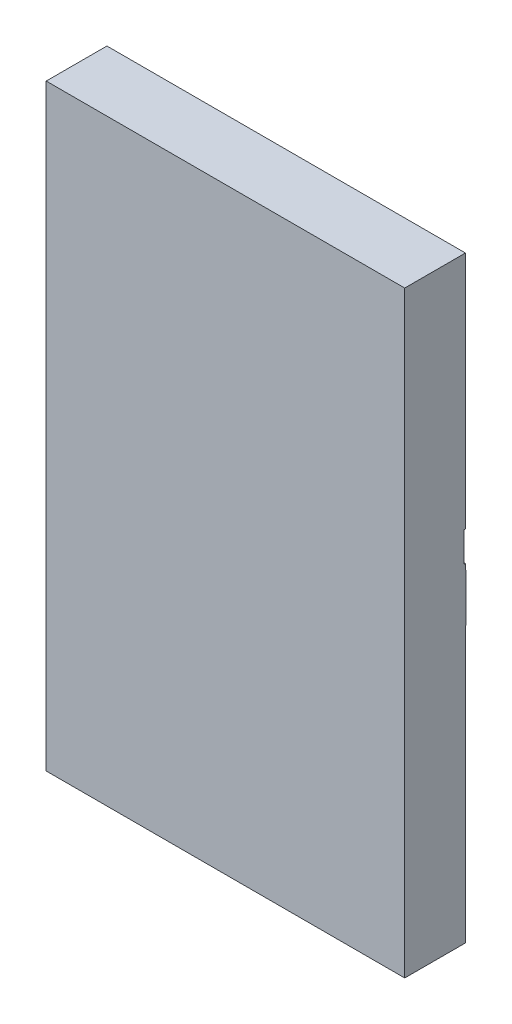
ISO-10303-21;
HEADER;
FILE_DESCRIPTION(('STEP AP214'),'2;1');
FILE_NAME('part.step','',(''),(''),'','','');
FILE_SCHEMA(('AUTOMOTIVE_DESIGN { 1 0 10303 214 1 1 1 1 }'));
ENDSEC;
DATA;
#1=APPLICATION_CONTEXT('core data for automotive mechanical design processes');
#2=APPLICATION_PROTOCOL_DEFINITION('international standard','automotive_design',2000,#1);
#3=PRODUCT_CONTEXT('',#1,'mechanical');
#4=PRODUCT('Part','Part','',(#3));
#5=PRODUCT_RELATED_PRODUCT_CATEGORY('part','',(#4));
#6=PRODUCT_DEFINITION_FORMATION('','',#4);
#7=PRODUCT_DEFINITION_CONTEXT('part definition',#1,'design');
#8=PRODUCT_DEFINITION('design','',#6,#7);
#9=PRODUCT_DEFINITION_SHAPE('','',#8);
#10=(LENGTH_UNIT() NAMED_UNIT(*) SI_UNIT(.MILLI.,.METRE.));
#11=(NAMED_UNIT(*) PLANE_ANGLE_UNIT() SI_UNIT($,.RADIAN.));
#12=(NAMED_UNIT(*) SI_UNIT($,.STERADIAN.) SOLID_ANGLE_UNIT());
#13=UNCERTAINTY_MEASURE_WITH_UNIT(LENGTH_MEASURE(1.E-05),#10,'distance_accuracy_value','');
#14=(GEOMETRIC_REPRESENTATION_CONTEXT(3) GLOBAL_UNCERTAINTY_ASSIGNED_CONTEXT((#13)) GLOBAL_UNIT_ASSIGNED_CONTEXT((#10,
#11,#12)) REPRESENTATION_CONTEXT('',''));
#15=CARTESIAN_POINT('',(0.,0.,0.));
#16=DIRECTION('',(0.,0.,1.));
#17=DIRECTION('',(1.,0.,0.));
#18=AXIS2_PLACEMENT_3D('',#15,#16,#17);
#19=CARTESIAN_POINT('',(0.00100000000000012,2.75,-0.100000000000003));
#20=DIRECTION('',(0.,0.,-1.));
#21=DIRECTION('',(0.,1.,0.));
#22=AXIS2_PLACEMENT_3D('',#19,#20,#21);
#23=PLANE('',#22);
#24=DIRECTION('',(1.,0.,0.));
#25=VECTOR('',#24,1.);
#26=CARTESIAN_POINT('',(0.000999999999999855,2.505,-0.100000000000002));
#27=LINE('',#26,#25);
#28=CARTESIAN_POINT('',(0.00100000000000013,2.505,-0.100000000000002));
#29=VERTEX_POINT('',#28);
#30=CARTESIAN_POINT('',(2.001,2.505,-0.100000000000002));
#31=VERTEX_POINT('',#30);
#32=EDGE_CURVE('E44',#29,#31,#27,.T.);
#33=ORIENTED_EDGE('',*,*,#32,.F.);
#34=DIRECTION('',(0.,1.,0.));
#35=VECTOR('',#34,1.);
#36=CARTESIAN_POINT('',(0.00100000000000012,2.25,-0.100000000000002));
#37=LINE('',#36,#35);
#38=CARTESIAN_POINT('',(0.00100000000000012,2.75,-0.100000000000003));
#39=VERTEX_POINT('',#38);
#40=EDGE_CURVE('E240',#29,#39,#37,.T.);
#41=ORIENTED_EDGE('',*,*,#40,.T.);
#42=DIRECTION('',(1.,0.,0.));
#43=VECTOR('',#42,1.);
#44=CARTESIAN_POINT('',(0.00100000000000012,2.75,-0.100000000000003));
#45=LINE('',#44,#43);
#46=CARTESIAN_POINT('',(2.001,2.75,-0.100000000000003));
#47=VERTEX_POINT('',#46);
#48=EDGE_CURVE('E239',#39,#47,#45,.T.);
#49=ORIENTED_EDGE('',*,*,#48,.T.);
#50=DIRECTION('',(0.,-1.,0.));
#51=VECTOR('',#50,1.);
#52=CARTESIAN_POINT('',(2.001,2.25,-0.100000000000002));
#53=LINE('',#52,#51);
#54=EDGE_CURVE('E248',#47,#31,#53,.T.);
#55=ORIENTED_EDGE('',*,*,#54,.T.);
#56=EDGE_LOOP('',(#33,#41,#49,#55));
#57=FACE_BOUND('',#56,.T.);
#58=ADVANCED_FACE('F36',(#57),#23,.T.);
#59=CARTESIAN_POINT('',(0.,2.7,-0.00299999999999998));
#60=DIRECTION('',(0.,0.,-1.));
#61=DIRECTION('',(0.,1.,0.));
#62=AXIS2_PLACEMENT_3D('',#59,#60,#61);
#63=PLANE('',#62);
#64=DIRECTION('',(0.,1.,0.));
#65=VECTOR('',#64,1.);
#66=CARTESIAN_POINT('',(0.00100000000000013,2.25,-0.00300000000000221));
#67=LINE('',#66,#65);
#68=CARTESIAN_POINT('',(0.00100000000000013,2.3,-0.00300000000000003));
#69=VERTEX_POINT('',#68);
#70=CARTESIAN_POINT('',(0.00100000000000013,2.7,-0.00299999999999998));
#71=VERTEX_POINT('',#70);
#72=EDGE_CURVE('E222',#69,#71,#67,.T.);
#73=ORIENTED_EDGE('',*,*,#72,.F.);
#74=DIRECTION('',(1.,0.,0.));
#75=VECTOR('',#74,1.);
#76=CARTESIAN_POINT('',(0.,2.3,-0.00300000000000003));
#77=LINE('',#76,#75);
#78=CARTESIAN_POINT('',(0.,2.3,-0.00300000000000003));
#79=VERTEX_POINT('',#78);
#80=EDGE_CURVE('E300',#79,#69,#77,.T.);
#81=ORIENTED_EDGE('',*,*,#80,.F.);
#82=DIRECTION('',(0.,1.,0.));
#83=VECTOR('',#82,1.);
#84=CARTESIAN_POINT('',(0.,2.7,-0.00299999999999998));
#85=LINE('',#84,#83);
#86=CARTESIAN_POINT('',(0.,2.7,-0.00299999999999998));
#87=VERTEX_POINT('',#86);
#88=EDGE_CURVE('E278',#79,#87,#85,.T.);
#89=ORIENTED_EDGE('',*,*,#88,.T.);
#90=DIRECTION('',(1.,0.,0.));
#91=VECTOR('',#90,1.);
#92=CARTESIAN_POINT('',(0.,2.7,-0.00299999999999998));
#93=LINE('',#92,#91);
#94=EDGE_CURVE('E295',#87,#71,#93,.T.);
#95=ORIENTED_EDGE('',*,*,#94,.T.);
#96=EDGE_LOOP('',(#73,#81,#89,#95));
#97=FACE_BOUND('',#96,.T.);
#98=ADVANCED_FACE('F517',(#97),#63,.T.);
#99=CARTESIAN_POINT('',(0.,5.,0.));
#100=DIRECTION('',(0.,0.,-1.));
#101=DIRECTION('',(-1.,0.,0.));
#102=AXIS2_PLACEMENT_3D('',#99,#100,#101);
#103=PLANE('',#102);
#104=CARTESIAN_POINT('',(0.1,2.2,0.));
#105=DIRECTION('',(0.,0.,-1.));
#106=DIRECTION('',(-1.,0.,0.));
#107=AXIS2_PLACEMENT_3D('',#104,#105,#106);
#108=CIRCLE('',#107,0.0200000000000001);
#109=CARTESIAN_POINT('',(0.0799999999999999,2.2,0.));
#110=VERTEX_POINT('',#109);
#111=EDGE_CURVE('E386',#110,#110,#108,.F.);
#112=ORIENTED_EDGE('',*,*,#111,.T.);
#113=EDGE_LOOP('',(#112));
#114=FACE_BOUND('',#113,.T.);
#115=CARTESIAN_POINT('',(2.9,2.2,0.));
#116=DIRECTION('',(0.,0.,-1.));
#117=DIRECTION('',(-1.,0.,0.));
#118=AXIS2_PLACEMENT_3D('',#115,#116,#117);
#119=CIRCLE('',#118,0.0200000000000002);
#120=CARTESIAN_POINT('',(2.88,2.2,0.));
#121=VERTEX_POINT('',#120);
#122=EDGE_CURVE('E371',#121,#121,#119,.F.);
#123=ORIENTED_EDGE('',*,*,#122,.T.);
#124=EDGE_LOOP('',(#123));
#125=FACE_BOUND('',#124,.T.);
#126=DIRECTION('',(0.,1.,0.));
#127=VECTOR('',#126,1.);
#128=CARTESIAN_POINT('',(0.0500000000000006,5.,0.));
#129=LINE('',#128,#127);
#130=CARTESIAN_POINT('',(0.0499999999999997,0.0499999999999997,0.));
#131=VERTEX_POINT('',#130);
#132=CARTESIAN_POINT('',(0.0500000000000001,2.2,0.));
#133=VERTEX_POINT('',#132);
#134=EDGE_CURVE('E410',#131,#133,#129,.T.);
#135=ORIENTED_EDGE('',*,*,#134,.T.);
#136=DIRECTION('',(-1.,0.,0.));
#137=VECTOR('',#136,1.);
#138=CARTESIAN_POINT('',(0.,2.2,0.));
#139=LINE('',#138,#137);
#140=CARTESIAN_POINT('',(0.,2.2,0.));
#141=VERTEX_POINT('',#140);
#142=EDGE_CURVE('E414',#133,#141,#139,.T.);
#143=ORIENTED_EDGE('',*,*,#142,.T.);
#144=DIRECTION('',(0.,-1.,0.));
#145=VECTOR('',#144,1.);
#146=CARTESIAN_POINT('',(0.,0.,0.));
#147=LINE('',#146,#145);
#148=CARTESIAN_POINT('',(0.,2.3,0.));
#149=VERTEX_POINT('',#148);
#150=EDGE_CURVE('E837',#149,#141,#147,.T.);
#151=ORIENTED_EDGE('',*,*,#150,.F.);
#152=DIRECTION('',(1.,0.,0.));
#153=VECTOR('',#152,1.);
#154=CARTESIAN_POINT('',(0.,2.3,0.));
#155=LINE('',#154,#153);
#156=CARTESIAN_POINT('',(3.,2.3,0.));
#157=VERTEX_POINT('',#156);
#158=EDGE_CURVE('E284',#149,#157,#155,.T.);
#159=ORIENTED_EDGE('',*,*,#158,.T.);
#160=DIRECTION('',(0.,1.,0.));
#161=VECTOR('',#160,1.);
#162=CARTESIAN_POINT('',(3.,0.,0.));
#163=LINE('',#162,#161);
#164=CARTESIAN_POINT('',(3.,2.2,0.));
#165=VERTEX_POINT('',#164);
#166=EDGE_CURVE('E358',#165,#157,#163,.T.);
#167=ORIENTED_EDGE('',*,*,#166,.F.);
#168=DIRECTION('',(-1.,0.,0.));
#169=VECTOR('',#168,1.);
#170=CARTESIAN_POINT('',(0.,2.2,0.));
#171=LINE('',#170,#169);
#172=CARTESIAN_POINT('',(2.95,2.2,0.));
#173=VERTEX_POINT('',#172);
#174=EDGE_CURVE('E398',#165,#173,#171,.T.);
#175=ORIENTED_EDGE('',*,*,#174,.T.);
#176=DIRECTION('',(0.,-1.,0.));
#177=VECTOR('',#176,1.);
#178=CARTESIAN_POINT('',(2.95,5.,0.));
#179=LINE('',#178,#177);
#180=CARTESIAN_POINT('',(2.95,0.0499999999999997,0.));
#181=VERTEX_POINT('',#180);
#182=EDGE_CURVE('E402',#173,#181,#179,.T.);
#183=ORIENTED_EDGE('',*,*,#182,.T.);
#184=DIRECTION('',(-1.,0.,0.));
#185=VECTOR('',#184,1.);
#186=CARTESIAN_POINT('',(0.,0.0499999999999997,0.));
#187=LINE('',#186,#185);
#188=EDGE_CURVE('E406',#181,#131,#187,.T.);
#189=ORIENTED_EDGE('',*,*,#188,.T.);
#190=EDGE_LOOP('',(#135,#143,#151,#159,#167,#175,#183,#189));
#191=FACE_BOUND('',#190,.T.);
#192=ADVANCED_FACE('F486',(#114,#125,#191),#103,.T.);
#193=CARTESIAN_POINT('',(0.1,3.1,0.));
#194=DIRECTION('',(0.,0.,-1.));
#195=DIRECTION('',(-1.,0.,0.));
#196=AXIS2_PLACEMENT_3D('',#193,#194,#195);
#197=CIRCLE('',#196,0.0200000000000001);
#198=CARTESIAN_POINT('',(0.0799999999999999,3.1,0.));
#199=VERTEX_POINT('',#198);
#200=EDGE_CURVE('E390',#199,#199,#197,.F.);
#201=ORIENTED_EDGE('',*,*,#200,.T.);
#202=EDGE_LOOP('',(#201));
#203=FACE_BOUND('',#202,.T.);
#204=DIRECTION('',(0.,-1.,0.));
#205=VECTOR('',#204,1.);
#206=CARTESIAN_POINT('',(0.05,5.,0.));
#207=LINE('',#206,#205);
#208=CARTESIAN_POINT('',(0.05,4.95,0.));
#209=VERTEX_POINT('',#208);
#210=CARTESIAN_POINT('',(0.0499999999999999,3.,0.));
#211=VERTEX_POINT('',#210);
#212=EDGE_CURVE('E383',#209,#211,#207,.T.);
#213=ORIENTED_EDGE('',*,*,#212,.F.);
#214=DIRECTION('',(-1.,0.,0.));
#215=VECTOR('',#214,1.);
#216=CARTESIAN_POINT('',(0.,4.95,0.));
#217=LINE('',#216,#215);
#218=CARTESIAN_POINT('',(2.95,4.95,0.));
#219=VERTEX_POINT('',#218);
#220=EDGE_CURVE('E379',#219,#209,#217,.T.);
#221=ORIENTED_EDGE('',*,*,#220,.F.);
#222=DIRECTION('',(0.,1.,0.));
#223=VECTOR('',#222,1.);
#224=CARTESIAN_POINT('',(2.95,5.,0.));
#225=LINE('',#224,#223);
#226=CARTESIAN_POINT('',(2.95,3.,0.));
#227=VERTEX_POINT('',#226);
#228=EDGE_CURVE('E375',#227,#219,#225,.T.);
#229=ORIENTED_EDGE('',*,*,#228,.F.);
#230=DIRECTION('',(1.,0.,0.));
#231=VECTOR('',#230,1.);
#232=CARTESIAN_POINT('',(0.,3.,0.));
#233=LINE('',#232,#231);
#234=EDGE_CURVE('E336',#211,#227,#233,.T.);
#235=ORIENTED_EDGE('',*,*,#234,.F.);
#236=EDGE_LOOP('',(#213,#221,#229,#235));
#237=FACE_BOUND('',#236,.T.);
#238=CARTESIAN_POINT('',(2.9,3.1,0.));
#239=DIRECTION('',(0.,0.,-1.));
#240=DIRECTION('',(-1.,0.,0.));
#241=AXIS2_PLACEMENT_3D('',#238,#239,#240);
#242=CIRCLE('',#241,0.0200000000000002);
#243=CARTESIAN_POINT('',(2.88,3.1,0.));
#244=VERTEX_POINT('',#243);
#245=EDGE_CURVE('E394',#244,#244,#242,.F.);
#246=ORIENTED_EDGE('',*,*,#245,.T.);
#247=EDGE_LOOP('',(#246));
#248=FACE_BOUND('',#247,.T.);
#249=ADVANCED_FACE('F579',(#203,#237,#248),#103,.T.);
#250=ORIENTED_EDGE('',*,*,#245,.F.);
#251=EDGE_LOOP('',(#250));
#252=FACE_BOUND('',#251,.T.);
#253=ADVANCED_FACE('F584',(#252),#103,.T.);
#254=ORIENTED_EDGE('',*,*,#142,.F.);
#255=ORIENTED_EDGE('',*,*,#134,.F.);
#256=ORIENTED_EDGE('',*,*,#188,.F.);
#257=ORIENTED_EDGE('',*,*,#182,.F.);
#258=ORIENTED_EDGE('',*,*,#174,.F.);
#259=CARTESIAN_POINT('',(3.,0.,0.));
#260=VERTEX_POINT('',#259);
#261=EDGE_CURVE('E355',#260,#165,#163,.T.);
#262=ORIENTED_EDGE('',*,*,#261,.F.);
#263=DIRECTION('',(1.,0.,0.));
#264=VECTOR('',#263,1.);
#265=CARTESIAN_POINT('',(0.,0.,0.));
#266=LINE('',#265,#264);
#267=CARTESIAN_POINT('',(0.,0.,0.));
#268=VERTEX_POINT('',#267);
#269=EDGE_CURVE('E351',#268,#260,#266,.T.);
#270=ORIENTED_EDGE('',*,*,#269,.F.);
#271=EDGE_CURVE('E328',#141,#268,#147,.T.);
#272=ORIENTED_EDGE('',*,*,#271,.F.);
#273=EDGE_LOOP('',(#254,#255,#256,#257,#258,#262,#270,#272));
#274=FACE_BOUND('',#273,.T.);
#275=ADVANCED_FACE('F482',(#274),#103,.T.);
#276=ORIENTED_EDGE('',*,*,#220,.T.);
#277=ORIENTED_EDGE('',*,*,#212,.T.);
#278=CARTESIAN_POINT('',(0.,3.,0.));
#279=VERTEX_POINT('',#278);
#280=EDGE_CURVE('E333',#279,#211,#233,.T.);
#281=ORIENTED_EDGE('',*,*,#280,.F.);
#282=CARTESIAN_POINT('',(0.,5.,0.));
#283=VERTEX_POINT('',#282);
#284=EDGE_CURVE('E348',#283,#279,#147,.T.);
#285=ORIENTED_EDGE('',*,*,#284,.F.);
#286=DIRECTION('',(-1.,0.,0.));
#287=VECTOR('',#286,1.);
#288=CARTESIAN_POINT('',(0.,5.,0.));
#289=LINE('',#288,#287);
#290=CARTESIAN_POINT('',(3.,5.,0.));
#291=VERTEX_POINT('',#290);
#292=EDGE_CURVE('E341',#291,#283,#289,.T.);
#293=ORIENTED_EDGE('',*,*,#292,.F.);
#294=CARTESIAN_POINT('',(3.,3.,0.));
#295=VERTEX_POINT('',#294);
#296=EDGE_CURVE('E354',#295,#291,#163,.T.);
#297=ORIENTED_EDGE('',*,*,#296,.F.);
#298=EDGE_CURVE('E317',#227,#295,#233,.T.);
#299=ORIENTED_EDGE('',*,*,#298,.F.);
#300=ORIENTED_EDGE('',*,*,#228,.T.);
#301=EDGE_LOOP('',(#276,#277,#281,#285,#293,#297,#299,#300));
#302=FACE_BOUND('',#301,.T.);
#303=ADVANCED_FACE('F470',(#302),#103,.T.);
#304=ORIENTED_EDGE('',*,*,#111,.F.);
#305=EDGE_LOOP('',(#304));
#306=FACE_BOUND('',#305,.T.);
#307=ADVANCED_FACE('F575',(#306),#103,.T.);
#308=DIRECTION('',(1.,0.,0.));
#309=VECTOR('',#308,1.);
#310=CARTESIAN_POINT('',(0.,2.7,0.));
#311=LINE('',#310,#309);
#312=CARTESIAN_POINT('',(0.,2.7,0.));
#313=VERTEX_POINT('',#312);
#314=CARTESIAN_POINT('',(3.,2.7,0.));
#315=VERTEX_POINT('',#314);
#316=EDGE_CURVE('E291',#313,#315,#311,.T.);
#317=ORIENTED_EDGE('',*,*,#316,.F.);
#318=CARTESIAN_POINT('',(0.,2.75,0.));
#319=VERTEX_POINT('',#318);
#320=EDGE_CURVE('E352',#319,#313,#147,.T.);
#321=ORIENTED_EDGE('',*,*,#320,.F.);
#322=DIRECTION('',(1.,0.,0.));
#323=VECTOR('',#322,1.);
#324=CARTESIAN_POINT('',(0.,2.75,0.));
#325=LINE('',#324,#323);
#326=CARTESIAN_POINT('',(3.,2.75,0.));
#327=VERTEX_POINT('',#326);
#328=EDGE_CURVE('E325',#319,#327,#325,.T.);
#329=ORIENTED_EDGE('',*,*,#328,.T.);
#330=EDGE_CURVE('E454',#315,#327,#163,.T.);
#331=ORIENTED_EDGE('',*,*,#330,.F.);
#332=EDGE_LOOP('',(#317,#321,#329,#331));
#333=FACE_BOUND('',#332,.T.);
#334=ADVANCED_FACE('F455',(#333),#103,.T.);
#335=ORIENTED_EDGE('',*,*,#122,.F.);
#336=EDGE_LOOP('',(#335));
#337=FACE_BOUND('',#336,.T.);
#338=ADVANCED_FACE('F559',(#337),#103,.T.);
#339=CARTESIAN_POINT('',(0.,0.,0.508));
#340=DIRECTION('',(1.,0.,0.));
#341=DIRECTION('',(0.,0.,-1.));
#342=AXIS2_PLACEMENT_3D('',#339,#340,#341);
#343=PLANE('',#342);
#344=DIRECTION('',(0.,-1.,0.));
#345=VECTOR('',#344,1.);
#346=CARTESIAN_POINT('',(0.,3.,0.01));
#347=LINE('',#346,#345);
#348=CARTESIAN_POINT('',(0.,3.,0.01));
#349=VERTEX_POINT('',#348);
#350=CARTESIAN_POINT('',(0.,2.75,0.00999999999999997));
#351=VERTEX_POINT('',#350);
#352=EDGE_CURVE('E310',#349,#351,#347,.T.);
#353=ORIENTED_EDGE('',*,*,#352,.T.);
#354=DIRECTION('',(0.,0.,-1.));
#355=VECTOR('',#354,1.);
#356=CARTESIAN_POINT('',(0.,2.75,0.));
#357=LINE('',#356,#355);
#358=EDGE_CURVE('E314',#351,#319,#357,.T.);
#359=ORIENTED_EDGE('',*,*,#358,.T.);
#360=ORIENTED_EDGE('',*,*,#320,.T.);
#361=DIRECTION('',(0.,0.,1.));
#362=VECTOR('',#361,1.);
#363=CARTESIAN_POINT('',(0.,2.7,0.));
#364=LINE('',#363,#362);
#365=EDGE_CURVE('E282',#87,#313,#364,.T.);
#366=ORIENTED_EDGE('',*,*,#365,.F.);
#367=ORIENTED_EDGE('',*,*,#88,.F.);
#368=DIRECTION('',(0.,0.,-1.));
#369=VECTOR('',#368,1.);
#370=CARTESIAN_POINT('',(0.,2.3,0.));
#371=LINE('',#370,#369);
#372=EDGE_CURVE('E275',#149,#79,#371,.T.);
#373=ORIENTED_EDGE('',*,*,#372,.F.);
#374=ORIENTED_EDGE('',*,*,#150,.T.);
#375=ORIENTED_EDGE('',*,*,#271,.T.);
#376=DIRECTION('',(0.,0.,-1.));
#377=VECTOR('',#376,1.);
#378=CARTESIAN_POINT('',(0.,0.,0.508));
#379=LINE('',#378,#377);
#380=CARTESIAN_POINT('',(0.,0.,0.508));
#381=VERTEX_POINT('',#380);
#382=EDGE_CURVE('E368',#381,#268,#379,.T.);
#383=ORIENTED_EDGE('',*,*,#382,.F.);
#384=DIRECTION('',(0.,-1.,0.));
#385=VECTOR('',#384,1.);
#386=CARTESIAN_POINT('',(0.,0.,0.508));
#387=LINE('',#386,#385);
#388=CARTESIAN_POINT('',(0.,5.,0.508));
#389=VERTEX_POINT('',#388);
#390=EDGE_CURVE('E337',#389,#381,#387,.T.);
#391=ORIENTED_EDGE('',*,*,#390,.F.);
#392=DIRECTION('',(0.,0.,-1.));
#393=VECTOR('',#392,1.);
#394=CARTESIAN_POINT('',(0.,5.,0.508));
#395=LINE('',#394,#393);
#396=EDGE_CURVE('E347',#389,#283,#395,.T.);
#397=ORIENTED_EDGE('',*,*,#396,.T.);
#398=ORIENTED_EDGE('',*,*,#284,.T.);
#399=DIRECTION('',(0.,0.,1.));
#400=VECTOR('',#399,1.);
#401=CARTESIAN_POINT('',(0.,3.,0.));
#402=LINE('',#401,#400);
#403=EDGE_CURVE('E307',#279,#349,#402,.T.);
#404=ORIENTED_EDGE('',*,*,#403,.T.);
#405=EDGE_LOOP('',(#353,#359,#360,#366,#367,#373,#374,#375,#383,#391,#397,#398,#404));
#406=FACE_BOUND('',#405,.T.);
#407=ADVANCED_FACE('F38',(#406),#343,.F.);
#408=CARTESIAN_POINT('',(0.,0.,0.508));
#409=DIRECTION('',(0.,1.,0.));
#410=DIRECTION('',(0.,0.,1.));
#411=AXIS2_PLACEMENT_3D('',#408,#409,#410);
#412=PLANE('',#411);
#413=ORIENTED_EDGE('',*,*,#269,.T.);
#414=DIRECTION('',(0.,0.,-1.));
#415=VECTOR('',#414,1.);
#416=CARTESIAN_POINT('',(3.,0.,0.508));
#417=LINE('',#416,#415);
#418=CARTESIAN_POINT('',(3.,0.,0.508));
#419=VERTEX_POINT('',#418);
#420=EDGE_CURVE('E365',#419,#260,#417,.T.);
#421=ORIENTED_EDGE('',*,*,#420,.F.);
#422=DIRECTION('',(1.,0.,0.));
#423=VECTOR('',#422,1.);
#424=CARTESIAN_POINT('',(0.,0.,0.508));
#425=LINE('',#424,#423);
#426=EDGE_CURVE('E340',#381,#419,#425,.T.);
#427=ORIENTED_EDGE('',*,*,#426,.F.);
#428=ORIENTED_EDGE('',*,*,#382,.T.);
#429=EDGE_LOOP('',(#413,#421,#427,#428));
#430=FACE_BOUND('',#429,.T.);
#431=ADVANCED_FACE('F563',(#430),#412,.F.);
#432=CARTESIAN_POINT('',(3.,0.,0.508));
#433=DIRECTION('',(-1.,0.,0.));
#434=DIRECTION('',(0.,0.,1.));
#435=AXIS2_PLACEMENT_3D('',#432,#433,#434);
#436=PLANE('',#435);
#437=ORIENTED_EDGE('',*,*,#261,.T.);
#438=ORIENTED_EDGE('',*,*,#166,.T.);
#439=DIRECTION('',(0.,0.,-1.));
#440=VECTOR('',#439,1.);
#441=CARTESIAN_POINT('',(3.,2.3,0.));
#442=LINE('',#441,#440);
#443=CARTESIAN_POINT('',(3.,2.3,-0.00300000000000003));
#444=VERTEX_POINT('',#443);
#445=EDGE_CURVE('E274',#157,#444,#442,.T.);
#446=ORIENTED_EDGE('',*,*,#445,.T.);
#447=DIRECTION('',(0.,1.,0.));
#448=VECTOR('',#447,1.);
#449=CARTESIAN_POINT('',(3.,2.7,-0.00299999999999998));
#450=LINE('',#449,#448);
#451=CARTESIAN_POINT('',(3.,2.7,-0.00299999999999998));
#452=VERTEX_POINT('',#451);
#453=EDGE_CURVE('E287',#444,#452,#450,.T.);
#454=ORIENTED_EDGE('',*,*,#453,.T.);
#455=DIRECTION('',(0.,0.,1.));
#456=VECTOR('',#455,1.);
#457=CARTESIAN_POINT('',(3.,2.7,0.));
#458=LINE('',#457,#456);
#459=EDGE_CURVE('E279',#452,#315,#458,.T.);
#460=ORIENTED_EDGE('',*,*,#459,.T.);
#461=ORIENTED_EDGE('',*,*,#330,.T.);
#462=DIRECTION('',(0.,0.,-1.));
#463=VECTOR('',#462,1.);
#464=CARTESIAN_POINT('',(3.,2.75,0.));
#465=LINE('',#464,#463);
#466=CARTESIAN_POINT('',(3.,2.75,0.00999999999999997));
#467=VERTEX_POINT('',#466);
#468=EDGE_CURVE('E311',#467,#327,#465,.T.);
#469=ORIENTED_EDGE('',*,*,#468,.F.);
#470=DIRECTION('',(0.,-1.,0.));
#471=VECTOR('',#470,1.);
#472=CARTESIAN_POINT('',(3.,3.,0.01));
#473=LINE('',#472,#471);
#474=CARTESIAN_POINT('',(3.,3.,0.01));
#475=VERTEX_POINT('',#474);
#476=EDGE_CURVE('E320',#475,#467,#473,.T.);
#477=ORIENTED_EDGE('',*,*,#476,.F.);
#478=DIRECTION('',(0.,0.,1.));
#479=VECTOR('',#478,1.);
#480=CARTESIAN_POINT('',(3.,3.,0.));
#481=LINE('',#480,#479);
#482=EDGE_CURVE('E294',#295,#475,#481,.T.);
#483=ORIENTED_EDGE('',*,*,#482,.F.);
#484=ORIENTED_EDGE('',*,*,#296,.T.);
#485=DIRECTION('',(0.,0.,-1.));
#486=VECTOR('',#485,1.);
#487=CARTESIAN_POINT('',(3.,5.,0.508));
#488=LINE('',#487,#486);
#489=CARTESIAN_POINT('',(3.,5.,0.508));
#490=VERTEX_POINT('',#489);
#491=EDGE_CURVE('E362',#490,#291,#488,.T.);
#492=ORIENTED_EDGE('',*,*,#491,.F.);
#493=DIRECTION('',(0.,1.,0.));
#494=VECTOR('',#493,1.);
#495=CARTESIAN_POINT('',(3.,0.,0.508));
#496=LINE('',#495,#494);
#497=EDGE_CURVE('E343',#419,#490,#496,.T.);
#498=ORIENTED_EDGE('',*,*,#497,.F.);
#499=ORIENTED_EDGE('',*,*,#420,.T.);
#500=EDGE_LOOP('',(#437,#438,#446,#454,#460,#461,#469,#477,#483,#484,#492,#498,#499));
#501=FACE_BOUND('',#500,.T.);
#502=ADVANCED_FACE('F445',(#501),#436,.F.);
#503=CARTESIAN_POINT('',(0.,5.,0.508));
#504=DIRECTION('',(0.,-1.,0.));
#505=DIRECTION('',(0.,0.,-1.));
#506=AXIS2_PLACEMENT_3D('',#503,#504,#505);
#507=PLANE('',#506);
#508=ORIENTED_EDGE('',*,*,#292,.T.);
#509=ORIENTED_EDGE('',*,*,#396,.F.);
#510=DIRECTION('',(-1.,0.,0.));
#511=VECTOR('',#510,1.);
#512=CARTESIAN_POINT('',(0.,5.,0.508));
#513=LINE('',#512,#511);
#514=EDGE_CURVE('E345',#490,#389,#513,.T.);
#515=ORIENTED_EDGE('',*,*,#514,.F.);
#516=ORIENTED_EDGE('',*,*,#491,.T.);
#517=EDGE_LOOP('',(#508,#509,#515,#516));
#518=FACE_BOUND('',#517,.T.);
#519=ADVANCED_FACE('F467',(#518),#507,.F.);
#520=CARTESIAN_POINT('',(0.,5.,0.508));
#521=DIRECTION('',(0.,0.,-1.));
#522=DIRECTION('',(-1.,0.,0.));
#523=AXIS2_PLACEMENT_3D('',#520,#521,#522);
#524=PLANE('',#523);
#525=ORIENTED_EDGE('',*,*,#390,.T.);
#526=ORIENTED_EDGE('',*,*,#426,.T.);
#527=ORIENTED_EDGE('',*,*,#497,.T.);
#528=ORIENTED_EDGE('',*,*,#514,.T.);
#529=EDGE_LOOP('',(#525,#526,#527,#528));
#530=FACE_BOUND('',#529,.T.);
#531=ADVANCED_FACE('F476',(#530),#524,.F.);
#532=ORIENTED_EDGE('',*,*,#200,.F.);
#533=EDGE_LOOP('',(#532));
#534=FACE_BOUND('',#533,.T.);
#535=ADVANCED_FACE('F545',(#534),#103,.T.);
#536=CARTESIAN_POINT('',(0.,2.75,0.));
#537=DIRECTION('',(0.,-1.,0.));
#538=DIRECTION('',(0.,0.,-1.));
#539=AXIS2_PLACEMENT_3D('',#536,#537,#538);
#540=PLANE('',#539);
#541=ORIENTED_EDGE('',*,*,#468,.T.);
#542=ORIENTED_EDGE('',*,*,#328,.F.);
#543=ORIENTED_EDGE('',*,*,#358,.F.);
#544=DIRECTION('',(1.,0.,0.));
#545=VECTOR('',#544,1.);
#546=CARTESIAN_POINT('',(0.,2.75,0.00999999999999997));
#547=LINE('',#546,#545);
#548=EDGE_CURVE('E329',#351,#467,#547,.T.);
#549=ORIENTED_EDGE('',*,*,#548,.T.);
#550=EDGE_LOOP('',(#541,#542,#543,#549));
#551=FACE_BOUND('',#550,.T.);
#552=ADVANCED_FACE('F541',(#551),#540,.F.);
#553=CARTESIAN_POINT('',(0.,3.,0.01));
#554=DIRECTION('',(0.,0.,1.));
#555=DIRECTION('',(0.,-1.,0.));
#556=AXIS2_PLACEMENT_3D('',#553,#554,#555);
#557=PLANE('',#556);
#558=ORIENTED_EDGE('',*,*,#476,.T.);
#559=ORIENTED_EDGE('',*,*,#548,.F.);
#560=ORIENTED_EDGE('',*,*,#352,.F.);
#561=DIRECTION('',(1.,0.,0.));
#562=VECTOR('',#561,1.);
#563=CARTESIAN_POINT('',(0.,3.,0.01));
#564=LINE('',#563,#562);
#565=EDGE_CURVE('E331',#349,#475,#564,.T.);
#566=ORIENTED_EDGE('',*,*,#565,.T.);
#567=EDGE_LOOP('',(#558,#559,#560,#566));
#568=FACE_BOUND('',#567,.T.);
#569=ADVANCED_FACE('F544',(#568),#557,.F.);
#570=CARTESIAN_POINT('',(0.,3.,0.));
#571=DIRECTION('',(0.,1.,0.));
#572=DIRECTION('',(0.,0.,1.));
#573=AXIS2_PLACEMENT_3D('',#570,#571,#572);
#574=PLANE('',#573);
#575=ORIENTED_EDGE('',*,*,#482,.T.);
#576=ORIENTED_EDGE('',*,*,#565,.F.);
#577=ORIENTED_EDGE('',*,*,#403,.F.);
#578=ORIENTED_EDGE('',*,*,#280,.T.);
#579=ORIENTED_EDGE('',*,*,#234,.T.);
#580=ORIENTED_EDGE('',*,*,#298,.T.);
#581=EDGE_LOOP('',(#575,#576,#577,#578,#579,#580));
#582=FACE_BOUND('',#581,.T.);
#583=ADVANCED_FACE('F549',(#582),#574,.F.);
#584=CARTESIAN_POINT('',(0.,2.7,0.));
#585=DIRECTION('',(0.,1.,0.));
#586=DIRECTION('',(0.,0.,1.));
#587=AXIS2_PLACEMENT_3D('',#584,#585,#586);
#588=PLANE('',#587);
#589=ORIENTED_EDGE('',*,*,#459,.F.);
#590=CARTESIAN_POINT('',(2.001,2.7,-0.00299999999999998));
#591=VERTEX_POINT('',#590);
#592=EDGE_CURVE('E299',#591,#452,#93,.T.);
#593=ORIENTED_EDGE('',*,*,#592,.F.);
#594=EDGE_CURVE('E298',#71,#591,#93,.T.);
#595=ORIENTED_EDGE('',*,*,#594,.F.);
#596=ORIENTED_EDGE('',*,*,#94,.F.);
#597=ORIENTED_EDGE('',*,*,#365,.T.);
#598=ORIENTED_EDGE('',*,*,#316,.T.);
#599=EDGE_LOOP('',(#589,#593,#595,#596,#597,#598));
#600=FACE_BOUND('',#599,.T.);
#601=ADVANCED_FACE('F447',(#600),#588,.T.);
#602=DIRECTION('',(0.,-1.,0.));
#603=VECTOR('',#602,1.);
#604=CARTESIAN_POINT('',(2.001,2.25,-0.00300000000000239));
#605=LINE('',#604,#603);
#606=CARTESIAN_POINT('',(2.001,2.3,-0.00300000000000243));
#607=VERTEX_POINT('',#606);
#608=EDGE_CURVE('E59',#591,#607,#605,.T.);
#609=ORIENTED_EDGE('',*,*,#608,.F.);
#610=ORIENTED_EDGE('',*,*,#592,.T.);
#611=ORIENTED_EDGE('',*,*,#453,.F.);
#612=EDGE_CURVE('E304',#607,#444,#77,.T.);
#613=ORIENTED_EDGE('',*,*,#612,.F.);
#614=EDGE_LOOP('',(#609,#610,#611,#613));
#615=FACE_BOUND('',#614,.T.);
#616=ADVANCED_FACE('F442',(#615),#63,.T.);
#617=CARTESIAN_POINT('',(0.,2.3,0.));
#618=DIRECTION('',(0.,-1.,0.));
#619=DIRECTION('',(0.,0.,-1.));
#620=AXIS2_PLACEMENT_3D('',#617,#618,#619);
#621=PLANE('',#620);
#622=ORIENTED_EDGE('',*,*,#445,.F.);
#623=ORIENTED_EDGE('',*,*,#158,.F.);
#624=ORIENTED_EDGE('',*,*,#372,.T.);
#625=ORIENTED_EDGE('',*,*,#80,.T.);
#626=EDGE_CURVE('E303',#69,#607,#77,.T.);
#627=ORIENTED_EDGE('',*,*,#626,.T.);
#628=ORIENTED_EDGE('',*,*,#612,.T.);
#629=EDGE_LOOP('',(#622,#623,#624,#625,#627,#628));
#630=FACE_BOUND('',#629,.T.);
#631=ADVANCED_FACE('F489',(#630),#621,.T.);
#632=CARTESIAN_POINT('',(0.00100000000000013,2.75,-0.00300000000000263));
#633=DIRECTION('',(0.,0.,-1.));
#634=DIRECTION('',(0.,1.,0.));
#635=AXIS2_PLACEMENT_3D('',#632,#633,#634);
#636=PLANE('',#635);
#637=CARTESIAN_POINT('',(0.00100000000000013,2.75,-0.00300000000000263));
#638=VERTEX_POINT('',#637);
#639=EDGE_CURVE('E257',#71,#638,#67,.T.);
#640=ORIENTED_EDGE('',*,*,#639,.F.);
#641=ORIENTED_EDGE('',*,*,#594,.T.);
#642=CARTESIAN_POINT('',(2.001,2.75,-0.00300000000000281));
#643=VERTEX_POINT('',#642);
#644=EDGE_CURVE('E260',#643,#591,#605,.T.);
#645=ORIENTED_EDGE('',*,*,#644,.F.);
#646=DIRECTION('',(1.,0.,0.));
#647=VECTOR('',#646,1.);
#648=CARTESIAN_POINT('',(0.00100000000000013,2.75,-0.00300000000000263));
#649=LINE('',#648,#647);
#650=EDGE_CURVE('E256',#638,#643,#649,.T.);
#651=ORIENTED_EDGE('',*,*,#650,.F.);
#652=EDGE_LOOP('',(#640,#641,#645,#651));
#653=FACE_BOUND('',#652,.T.);
#654=ADVANCED_FACE('F438',(#653),#636,.F.);
#655=CARTESIAN_POINT('',(0.00100000000000012,2.25,-0.100000000000002));
#656=DIRECTION('',(1.,0.,0.));
#657=DIRECTION('',(0.,0.,-1.));
#658=AXIS2_PLACEMENT_3D('',#655,#656,#657);
#659=PLANE('',#658);
#660=ORIENTED_EDGE('',*,*,#40,.F.);
#661=DIRECTION('',(0.,0.,1.));
#662=VECTOR('',#661,1.);
#663=CARTESIAN_POINT('',(0.00100000000000012,2.505,-0.100000000000024));
#664=LINE('',#663,#662);
#665=CARTESIAN_POINT('',(0.00100000000000013,2.505,-0.0950000000000022));
#666=VERTEX_POINT('',#665);
#667=EDGE_CURVE('E422',#29,#666,#664,.T.);
#668=ORIENTED_EDGE('',*,*,#667,.T.);
#669=DIRECTION('',(0.,-1.,0.));
#670=VECTOR('',#669,1.);
#671=CARTESIAN_POINT('',(0.00100000000000012,2.25,-0.0950000000000022));
#672=LINE('',#671,#670);
#673=CARTESIAN_POINT('',(0.00100000000000013,2.495,-0.0950000000000022));
#674=VERTEX_POINT('',#673);
#675=EDGE_CURVE('E232',#666,#674,#672,.T.);
#676=ORIENTED_EDGE('',*,*,#675,.T.);
#677=DIRECTION('',(0.,0.,-1.));
#678=VECTOR('',#677,1.);
#679=CARTESIAN_POINT('',(0.00100000000000012,2.495,-0.099999999999981));
#680=LINE('',#679,#678);
#681=CARTESIAN_POINT('',(0.00100000000000013,2.495,-0.100000000000002));
#682=VERTEX_POINT('',#681);
#683=EDGE_CURVE('E217',#674,#682,#680,.T.);
#684=ORIENTED_EDGE('',*,*,#683,.T.);
#685=CARTESIAN_POINT('',(0.00100000000000012,2.25,-0.100000000000002));
#686=VERTEX_POINT('',#685);
#687=EDGE_CURVE('E230',#686,#682,#37,.T.);
#688=ORIENTED_EDGE('',*,*,#687,.F.);
#689=DIRECTION('',(0.,0.,1.));
#690=VECTOR('',#689,1.);
#691=CARTESIAN_POINT('',(0.00100000000000012,2.25,-0.100000000000002));
#692=LINE('',#691,#690);
#693=CARTESIAN_POINT('',(0.00100000000000013,2.25,-0.00300000000000221));
#694=VERTEX_POINT('',#693);
#695=EDGE_CURVE('E252',#686,#694,#692,.T.);
#696=ORIENTED_EDGE('',*,*,#695,.T.);
#697=EDGE_CURVE('E253',#694,#69,#67,.T.);
#698=ORIENTED_EDGE('',*,*,#697,.T.);
#699=ORIENTED_EDGE('',*,*,#72,.T.);
#700=ORIENTED_EDGE('',*,*,#639,.T.);
#701=DIRECTION('',(0.,0.,1.));
#702=VECTOR('',#701,1.);
#703=CARTESIAN_POINT('',(0.00100000000000012,2.75,-0.100000000000003));
#704=LINE('',#703,#702);
#705=EDGE_CURVE('E271',#39,#638,#704,.T.);
#706=ORIENTED_EDGE('',*,*,#705,.F.);
#707=EDGE_LOOP('',(#660,#668,#676,#684,#688,#696,#698,#699,#700,#706));
#708=FACE_BOUND('',#707,.T.);
#709=ADVANCED_FACE('F228',(#708),#659,.F.);
#710=CARTESIAN_POINT('',(0.00100000000000012,2.75,-0.100000000000003));
#711=DIRECTION('',(0.,-1.,0.));
#712=DIRECTION('',(0.,0.,-1.));
#713=AXIS2_PLACEMENT_3D('',#710,#711,#712);
#714=PLANE('',#713);
#715=ORIENTED_EDGE('',*,*,#650,.T.);
#716=DIRECTION('',(0.,0.,1.));
#717=VECTOR('',#716,1.);
#718=CARTESIAN_POINT('',(2.001,2.75,-0.100000000000003));
#719=LINE('',#718,#717);
#720=EDGE_CURVE('E268',#47,#643,#719,.T.);
#721=ORIENTED_EDGE('',*,*,#720,.F.);
#722=ORIENTED_EDGE('',*,*,#48,.F.);
#723=ORIENTED_EDGE('',*,*,#705,.T.);
#724=EDGE_LOOP('',(#715,#721,#722,#723));
#725=FACE_BOUND('',#724,.T.);
#726=ADVANCED_FACE('F432',(#725),#714,.F.);
#727=CARTESIAN_POINT('',(2.001,2.25,-0.100000000000002));
#728=DIRECTION('',(-1.,0.,0.));
#729=DIRECTION('',(0.,0.,1.));
#730=AXIS2_PLACEMENT_3D('',#727,#728,#729);
#731=PLANE('',#730);
#732=DIRECTION('',(0.,1.,0.));
#733=VECTOR('',#732,1.);
#734=CARTESIAN_POINT('',(2.001,2.25,-0.095000000000002));
#735=LINE('',#734,#733);
#736=CARTESIAN_POINT('',(2.001,2.495,-0.095000000000002));
#737=VERTEX_POINT('',#736);
#738=CARTESIAN_POINT('',(2.001,2.505,-0.095000000000002));
#739=VERTEX_POINT('',#738);
#740=EDGE_CURVE('E11',#737,#739,#735,.T.);
#741=ORIENTED_EDGE('',*,*,#740,.T.);
#742=DIRECTION('',(0.,0.,-1.));
#743=VECTOR('',#742,1.);
#744=CARTESIAN_POINT('',(2.001,2.505,-0.100000000000025));
#745=LINE('',#744,#743);
#746=EDGE_CURVE('E233',#739,#31,#745,.T.);
#747=ORIENTED_EDGE('',*,*,#746,.T.);
#748=ORIENTED_EDGE('',*,*,#54,.F.);
#749=ORIENTED_EDGE('',*,*,#720,.T.);
#750=ORIENTED_EDGE('',*,*,#644,.T.);
#751=ORIENTED_EDGE('',*,*,#608,.T.);
#752=CARTESIAN_POINT('',(2.001,2.25,-0.00300000000000239));
#753=VERTEX_POINT('',#752);
#754=EDGE_CURVE('E259',#607,#753,#605,.T.);
#755=ORIENTED_EDGE('',*,*,#754,.T.);
#756=DIRECTION('',(0.,0.,1.));
#757=VECTOR('',#756,1.);
#758=CARTESIAN_POINT('',(2.001,2.25,-0.100000000000002));
#759=LINE('',#758,#757);
#760=CARTESIAN_POINT('',(2.001,2.25,-0.100000000000002));
#761=VERTEX_POINT('',#760);
#762=EDGE_CURVE('E265',#761,#753,#759,.T.);
#763=ORIENTED_EDGE('',*,*,#762,.F.);
#764=CARTESIAN_POINT('',(2.001,2.495,-0.100000000000003));
#765=VERTEX_POINT('',#764);
#766=EDGE_CURVE('E242',#765,#761,#53,.T.);
#767=ORIENTED_EDGE('',*,*,#766,.F.);
#768=DIRECTION('',(0.,0.,1.));
#769=VECTOR('',#768,1.);
#770=CARTESIAN_POINT('',(2.001,2.495,-0.0999999999999811));
#771=LINE('',#770,#769);
#772=EDGE_CURVE('E51',#765,#737,#771,.T.);
#773=ORIENTED_EDGE('',*,*,#772,.T.);
#774=EDGE_LOOP('',(#741,#747,#748,#749,#750,#751,#755,#763,#767,#773));
#775=FACE_BOUND('',#774,.T.);
#776=ADVANCED_FACE('F426',(#775),#731,.F.);
#777=CARTESIAN_POINT('',(0.00100000000000012,2.25,-0.100000000000002));
#778=DIRECTION('',(0.,1.,0.));
#779=DIRECTION('',(0.,0.,1.));
#780=AXIS2_PLACEMENT_3D('',#777,#778,#779);
#781=PLANE('',#780);
#782=DIRECTION('',(-1.,0.,0.));
#783=VECTOR('',#782,1.);
#784=CARTESIAN_POINT('',(0.00100000000000013,2.25,-0.00300000000000221));
#785=LINE('',#784,#783);
#786=EDGE_CURVE('E244',#753,#694,#785,.T.);
#787=ORIENTED_EDGE('',*,*,#786,.T.);
#788=ORIENTED_EDGE('',*,*,#695,.F.);
#789=DIRECTION('',(-1.,0.,0.));
#790=VECTOR('',#789,1.);
#791=CARTESIAN_POINT('',(0.00100000000000012,2.25,-0.100000000000002));
#792=LINE('',#791,#790);
#793=EDGE_CURVE('E237',#761,#686,#792,.T.);
#794=ORIENTED_EDGE('',*,*,#793,.F.);
#795=ORIENTED_EDGE('',*,*,#762,.T.);
#796=EDGE_LOOP('',(#787,#788,#794,#795));
#797=FACE_BOUND('',#796,.T.);
#798=ADVANCED_FACE('F506',(#797),#781,.F.);
#799=DIRECTION('',(-1.,0.,0.));
#800=VECTOR('',#799,1.);
#801=CARTESIAN_POINT('',(0.000999999999999844,2.495,-0.100000000000002));
#802=LINE('',#801,#800);
#803=EDGE_CURVE('E214',#765,#682,#802,.T.);
#804=ORIENTED_EDGE('',*,*,#803,.F.);
#805=ORIENTED_EDGE('',*,*,#766,.T.);
#806=ORIENTED_EDGE('',*,*,#793,.T.);
#807=ORIENTED_EDGE('',*,*,#687,.T.);
#808=EDGE_LOOP('',(#804,#805,#806,#807));
#809=FACE_BOUND('',#808,.T.);
#810=ADVANCED_FACE('F235',(#809),#23,.T.);
#811=ORIENTED_EDGE('',*,*,#626,.F.);
#812=ORIENTED_EDGE('',*,*,#697,.F.);
#813=ORIENTED_EDGE('',*,*,#786,.F.);
#814=ORIENTED_EDGE('',*,*,#754,.F.);
#815=EDGE_LOOP('',(#811,#812,#813,#814));
#816=FACE_BOUND('',#815,.T.);
#817=ADVANCED_FACE('F495',(#816),#636,.F.);
#818=CARTESIAN_POINT('',(3.,2.495,-0.095000000000002));
#819=DIRECTION('',(0.,0.,1.));
#820=DIRECTION('',(1.,0.,0.));
#821=AXIS2_PLACEMENT_3D('',#818,#819,#820);
#822=PLANE('',#821);
#823=DIRECTION('',(-1.,0.,0.));
#824=VECTOR('',#823,1.);
#825=CARTESIAN_POINT('',(3.,2.505,-0.095000000000002));
#826=LINE('',#825,#824);
#827=EDGE_CURVE('E500',#739,#666,#826,.T.);
#828=ORIENTED_EDGE('',*,*,#827,.F.);
#829=ORIENTED_EDGE('',*,*,#740,.F.);
#830=DIRECTION('',(-1.,0.,0.));
#831=VECTOR('',#830,1.);
#832=CARTESIAN_POINT('',(3.,2.495,-0.095000000000002));
#833=LINE('',#832,#831);
#834=EDGE_CURVE('E501',#737,#674,#833,.T.);
#835=ORIENTED_EDGE('',*,*,#834,.T.);
#836=ORIENTED_EDGE('',*,*,#675,.F.);
#837=EDGE_LOOP('',(#828,#829,#835,#836));
#838=FACE_BOUND('',#837,.T.);
#839=ADVANCED_FACE('F504',(#838),#822,.F.);
#840=CARTESIAN_POINT('',(3.,2.505,-0.100000000000002));
#841=DIRECTION('',(0.,1.,0.));
#842=DIRECTION('',(0.,0.,1.));
#843=AXIS2_PLACEMENT_3D('',#840,#841,#842);
#844=PLANE('',#843);
#845=ORIENTED_EDGE('',*,*,#32,.T.);
#846=ORIENTED_EDGE('',*,*,#746,.F.);
#847=ORIENTED_EDGE('',*,*,#827,.T.);
#848=ORIENTED_EDGE('',*,*,#667,.F.);
#849=EDGE_LOOP('',(#845,#846,#847,#848));
#850=FACE_BOUND('',#849,.T.);
#851=ADVANCED_FACE('F419',(#850),#844,.F.);
#852=CARTESIAN_POINT('',(3.,2.495,-0.100000000000002));
#853=DIRECTION('',(0.,-1.,0.));
#854=DIRECTION('',(0.,0.,-1.));
#855=AXIS2_PLACEMENT_3D('',#852,#853,#854);
#856=PLANE('',#855);
#857=ORIENTED_EDGE('',*,*,#834,.F.);
#858=ORIENTED_EDGE('',*,*,#772,.F.);
#859=ORIENTED_EDGE('',*,*,#803,.T.);
#860=ORIENTED_EDGE('',*,*,#683,.F.);
#861=EDGE_LOOP('',(#857,#858,#859,#860));
#862=FACE_BOUND('',#861,.T.);
#863=ADVANCED_FACE('F216',(#862),#856,.F.);
#864=CLOSED_SHELL('',(#58,#98,#192,#249,#253,#275,#303,#307,#334,#338,#407,#431,#502,#519,#531,
#535,#552,#569,#583,#601,#616,#631,#654,#709,#726,#776,#798,#810,#817,#839,#851,#863));
#865=MANIFOLD_SOLID_BREP('B2',#864);
#866=ADVANCED_BREP_SHAPE_REPRESENTATION('',(#18,#865),#14);
#867=SHAPE_DEFINITION_REPRESENTATION(#9,#866);
ENDSEC;
END-ISO-10303-21;
